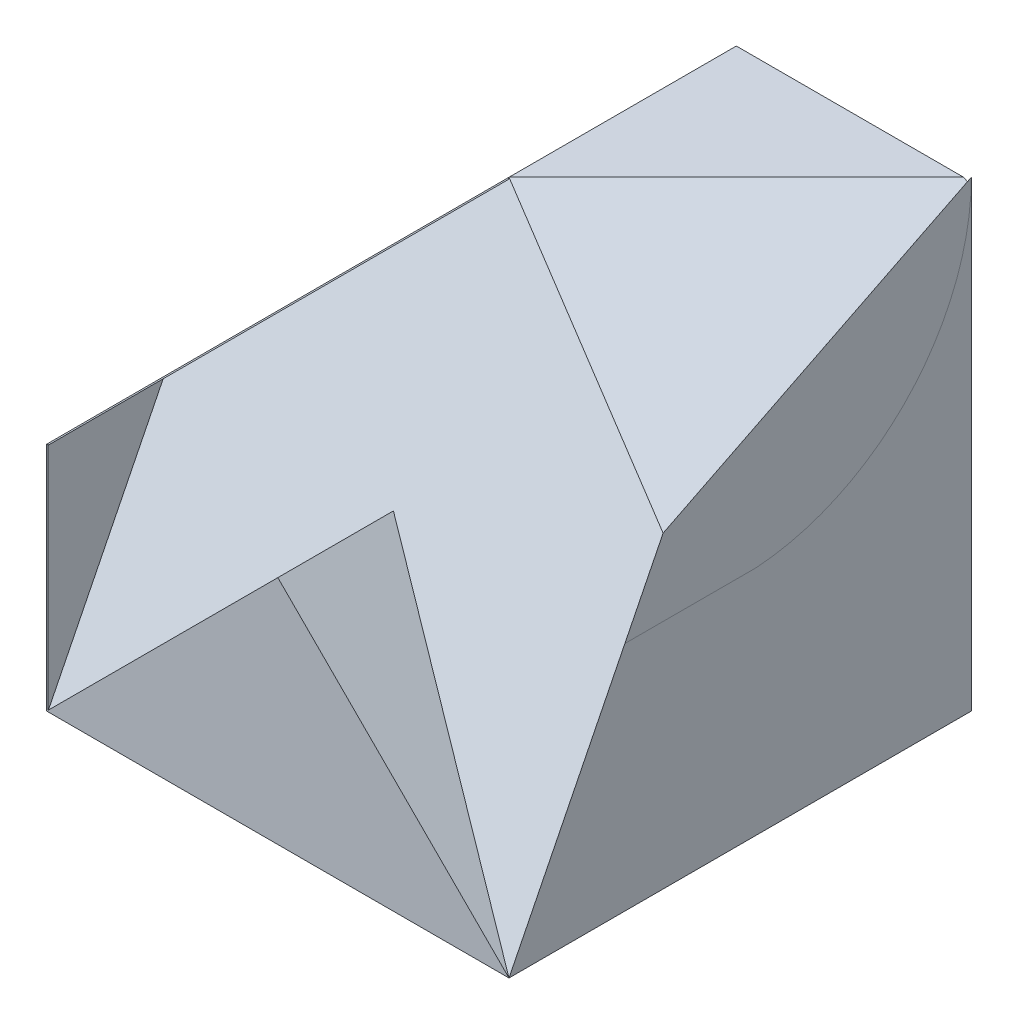
ISO-10303-21;
HEADER;
FILE_DESCRIPTION(('STEP AP214'),'2;1');
FILE_NAME('part.step','',(''),(''),'','','');
FILE_SCHEMA(('AUTOMOTIVE_DESIGN { 1 0 10303 214 1 1 1 1 }'));
ENDSEC;
DATA;
#1=APPLICATION_CONTEXT('core data for automotive mechanical design processes');
#2=APPLICATION_PROTOCOL_DEFINITION('international standard','automotive_design',2000,#1);
#3=PRODUCT_CONTEXT('',#1,'mechanical');
#4=PRODUCT('Part','Part','',(#3));
#5=PRODUCT_RELATED_PRODUCT_CATEGORY('part','',(#4));
#6=PRODUCT_DEFINITION_FORMATION('','',#4);
#7=PRODUCT_DEFINITION_CONTEXT('part definition',#1,'design');
#8=PRODUCT_DEFINITION('design','',#6,#7);
#9=PRODUCT_DEFINITION_SHAPE('','',#8);
#10=(LENGTH_UNIT() NAMED_UNIT(*) SI_UNIT(.MILLI.,.METRE.));
#11=(NAMED_UNIT(*) PLANE_ANGLE_UNIT() SI_UNIT($,.RADIAN.));
#12=(NAMED_UNIT(*) SI_UNIT($,.STERADIAN.) SOLID_ANGLE_UNIT());
#13=UNCERTAINTY_MEASURE_WITH_UNIT(LENGTH_MEASURE(1.E-05),#10,'distance_accuracy_value','');
#14=(GEOMETRIC_REPRESENTATION_CONTEXT(3) GLOBAL_UNCERTAINTY_ASSIGNED_CONTEXT((#13)) GLOBAL_UNIT_ASSIGNED_CONTEXT((#10,
#11,#12)) REPRESENTATION_CONTEXT('',''));
#15=CARTESIAN_POINT('',(0.,0.,0.));
#16=DIRECTION('',(0.,0.,1.));
#17=DIRECTION('',(1.,0.,0.));
#18=AXIS2_PLACEMENT_3D('',#15,#16,#17);
#19=CARTESIAN_POINT('',(60.,0.,60.));
#20=DIRECTION('',(-1.,0.,0.));
#21=DIRECTION('',(0.,0.,1.));
#22=AXIS2_PLACEMENT_3D('',#19,#20,#21);
#23=PLANE('',#22);
#24=CARTESIAN_POINT('',(60.,60.,30.));
#25=DIRECTION('',(1.,0.,0.));
#26=DIRECTION('',(0.,0.,1.));
#27=AXIS2_PLACEMENT_3D('',#24,#25,#26);
#28=CIRCLE('',#27,30.);
#29=CARTESIAN_POINT('',(60.,30.0742678610852,27.8903659203736));
#30=VERTEX_POINT('',#29);
#31=CARTESIAN_POINT('',(60.,60.,0.));
#32=VERTEX_POINT('',#31);
#33=EDGE_CURVE('E47',#30,#32,#28,.T.);
#34=ORIENTED_EDGE('',*,*,#33,.F.);
#35=DIRECTION('',(0.,0.,-1.));
#36=VECTOR('',#35,1.);
#37=CARTESIAN_POINT('',(60.,30.0742678610852,27.8903659203736));
#38=LINE('',#37,#36);
#39=CARTESIAN_POINT('',(60.,30.0742678610852,44.9628660694574));
#40=VERTEX_POINT('',#39);
#41=EDGE_CURVE('E161',#40,#30,#38,.T.);
#42=ORIENTED_EDGE('',*,*,#41,.F.);
#43=DIRECTION('',(0.,-0.894427190999916,0.447213595499959));
#44=VECTOR('',#43,1.);
#45=CARTESIAN_POINT('',(60.,0.,60.0000000000001));
#46=LINE('',#45,#44);
#47=CARTESIAN_POINT('',(60.,0.,60.));
#48=VERTEX_POINT('',#47);
#49=EDGE_CURVE('E241',#40,#48,#46,.T.);
#50=ORIENTED_EDGE('',*,*,#49,.T.);
#51=DIRECTION('',(0.,0.,-1.));
#52=VECTOR('',#51,1.);
#53=CARTESIAN_POINT('',(60.,0.,60.));
#54=LINE('',#53,#52);
#55=CARTESIAN_POINT('',(60.,0.,0.));
#56=VERTEX_POINT('',#55);
#57=EDGE_CURVE('E244',#48,#56,#54,.T.);
#58=ORIENTED_EDGE('',*,*,#57,.T.);
#59=DIRECTION('',(0.,1.,0.));
#60=VECTOR('',#59,1.);
#61=CARTESIAN_POINT('',(60.,0.,0.));
#62=LINE('',#61,#60);
#63=EDGE_CURVE('E234',#56,#32,#62,.T.);
#64=ORIENTED_EDGE('',*,*,#63,.T.);
#65=EDGE_LOOP('',(#34,#42,#50,#58,#64));
#66=FACE_BOUND('',#65,.T.);
#67=ADVANCED_FACE('F33',(#66),#23,.F.);
#68=CARTESIAN_POINT('',(30.,60.,0.));
#69=DIRECTION('',(0.707106781186547,-0.707106781186548,0.));
#70=DIRECTION('',(0.707106781186548,0.707106781186547,0.));
#71=AXIS2_PLACEMENT_3D('',#68,#69,#70);
#72=PLANE('',#71);
#73=DIRECTION('',(0.707106781186548,0.707106781186547,0.));
#74=VECTOR('',#73,1.);
#75=CARTESIAN_POINT('',(0.,30.,0.5));
#76=LINE('',#75,#74);
#77=CARTESIAN_POINT('',(0.,30.,0.5));
#78=VERTEX_POINT('',#77);
#79=CARTESIAN_POINT('',(30.,60.,0.5));
#80=VERTEX_POINT('',#79);
#81=EDGE_CURVE('E179',#78,#80,#76,.T.);
#82=ORIENTED_EDGE('',*,*,#81,.F.);
#83=DIRECTION('',(0.,0.,1.));
#84=VECTOR('',#83,1.);
#85=CARTESIAN_POINT('',(0.,30.,0.));
#86=LINE('',#85,#84);
#87=CARTESIAN_POINT('',(0.,30.,60.));
#88=VERTEX_POINT('',#87);
#89=EDGE_CURVE('E222',#78,#88,#86,.T.);
#90=ORIENTED_EDGE('',*,*,#89,.T.);
#91=DIRECTION('',(0.577350269189625,0.577350269189625,-0.577350269189626));
#92=VECTOR('',#91,1.);
#93=CARTESIAN_POINT('',(30.,60.,30.));
#94=LINE('',#93,#92);
#95=CARTESIAN_POINT('',(30.,60.,30.));
#96=VERTEX_POINT('',#95);
#97=EDGE_CURVE('E184',#88,#96,#94,.T.);
#98=ORIENTED_EDGE('',*,*,#97,.T.);
#99=DIRECTION('',(0.,0.,1.));
#100=VECTOR('',#99,1.);
#101=CARTESIAN_POINT('',(30.,60.,0.));
#102=LINE('',#101,#100);
#103=EDGE_CURVE('E231',#80,#96,#102,.T.);
#104=ORIENTED_EDGE('',*,*,#103,.F.);
#105=EDGE_LOOP('',(#82,#90,#98,#104));
#106=FACE_BOUND('',#105,.T.);
#107=ADVANCED_FACE('F292',(#106),#72,.F.);
#108=CARTESIAN_POINT('',(0.,60.,60.));
#109=DIRECTION('',(0.,-1.,0.));
#110=DIRECTION('',(0.,0.,-1.));
#111=AXIS2_PLACEMENT_3D('',#108,#109,#110);
#112=PLANE('',#111);
#113=DIRECTION('',(1.,0.,0.));
#114=VECTOR('',#113,1.);
#115=CARTESIAN_POINT('',(30.,60.,0.5));
#116=LINE('',#115,#114);
#117=CARTESIAN_POINT('',(59.5,60.,0.499999999999997));
#118=VERTEX_POINT('',#117);
#119=EDGE_CURVE('E55',#80,#118,#116,.T.);
#120=ORIENTED_EDGE('',*,*,#119,.F.);
#121=ORIENTED_EDGE('',*,*,#103,.T.);
#122=DIRECTION('',(-0.707106781186547,0.,0.707106781186548));
#123=VECTOR('',#122,1.);
#124=CARTESIAN_POINT('',(30.,60.,30.));
#125=LINE('',#124,#123);
#126=EDGE_CURVE('E226',#118,#96,#125,.T.);
#127=ORIENTED_EDGE('',*,*,#126,.F.);
#128=EDGE_LOOP('',(#120,#121,#127));
#129=FACE_BOUND('',#128,.T.);
#130=ADVANCED_FACE('F345',(#129),#112,.F.);
#131=CARTESIAN_POINT('',(0.,0.,60.));
#132=DIRECTION('',(1.,0.,0.));
#133=DIRECTION('',(0.,0.,-1.));
#134=AXIS2_PLACEMENT_3D('',#131,#132,#133);
#135=PLANE('',#134);
#136=DIRECTION('',(0.,0.,-1.));
#137=VECTOR('',#136,1.);
#138=CARTESIAN_POINT('',(0.,0.,60.));
#139=LINE('',#138,#137);
#140=CARTESIAN_POINT('',(0.,0.,60.));
#141=VERTEX_POINT('',#140);
#142=CARTESIAN_POINT('',(0.,0.,0.));
#143=VERTEX_POINT('',#142);
#144=EDGE_CURVE('E230',#141,#143,#139,.T.);
#145=ORIENTED_EDGE('',*,*,#144,.F.);
#146=DIRECTION('',(0.,1.,0.));
#147=VECTOR('',#146,1.);
#148=CARTESIAN_POINT('',(0.,0.,60.));
#149=LINE('',#148,#147);
#150=EDGE_CURVE('E198',#141,#88,#149,.T.);
#151=ORIENTED_EDGE('',*,*,#150,.T.);
#152=ORIENTED_EDGE('',*,*,#89,.F.);
#153=CARTESIAN_POINT('',(0.,30.,0.));
#154=VERTEX_POINT('',#153);
#155=EDGE_CURVE('E223',#154,#78,#86,.T.);
#156=ORIENTED_EDGE('',*,*,#155,.F.);
#157=DIRECTION('',(0.,-1.,0.));
#158=VECTOR('',#157,1.);
#159=CARTESIAN_POINT('',(0.,0.,0.));
#160=LINE('',#159,#158);
#161=EDGE_CURVE('E225',#154,#143,#160,.T.);
#162=ORIENTED_EDGE('',*,*,#161,.T.);
#163=EDGE_LOOP('',(#145,#151,#152,#156,#162));
#164=FACE_BOUND('',#163,.T.);
#165=ADVANCED_FACE('F287',(#164),#135,.F.);
#166=CARTESIAN_POINT('',(0.,0.,60.));
#167=DIRECTION('',(0.,1.,0.));
#168=DIRECTION('',(0.,0.,1.));
#169=AXIS2_PLACEMENT_3D('',#166,#167,#168);
#170=PLANE('',#169);
#171=DIRECTION('',(1.,0.,0.));
#172=VECTOR('',#171,1.);
#173=CARTESIAN_POINT('',(0.,0.,0.));
#174=LINE('',#173,#172);
#175=EDGE_CURVE('E233',#143,#56,#174,.T.);
#176=ORIENTED_EDGE('',*,*,#175,.T.);
#177=ORIENTED_EDGE('',*,*,#57,.F.);
#178=DIRECTION('',(1.,0.,0.));
#179=VECTOR('',#178,1.);
#180=CARTESIAN_POINT('',(0.,0.,60.));
#181=LINE('',#180,#179);
#182=EDGE_CURVE('E235',#141,#48,#181,.T.);
#183=ORIENTED_EDGE('',*,*,#182,.F.);
#184=ORIENTED_EDGE('',*,*,#144,.T.);
#185=EDGE_LOOP('',(#176,#177,#183,#184));
#186=FACE_BOUND('',#185,.T.);
#187=ADVANCED_FACE('F326',(#186),#170,.F.);
#188=CARTESIAN_POINT('',(0.,0.,0.));
#189=DIRECTION('',(0.,0.,-1.));
#190=DIRECTION('',(-1.,0.,0.));
#191=AXIS2_PLACEMENT_3D('',#188,#189,#190);
#192=PLANE('',#191);
#193=DIRECTION('',(-1.,0.,0.));
#194=VECTOR('',#193,1.);
#195=CARTESIAN_POINT('',(30.,30.,0.));
#196=LINE('',#195,#194);
#197=CARTESIAN_POINT('',(30.,30.,0.));
#198=VERTEX_POINT('',#197);
#199=EDGE_CURVE('E167',#198,#154,#196,.T.);
#200=ORIENTED_EDGE('',*,*,#199,.F.);
#201=CARTESIAN_POINT('',(30.,60.,0.));
#202=DIRECTION('',(0.,0.,-1.));
#203=DIRECTION('',(-1.,0.,0.));
#204=AXIS2_PLACEMENT_3D('',#201,#202,#203);
#205=CIRCLE('',#204,30.);
#206=EDGE_CURVE('E164',#32,#198,#205,.T.);
#207=ORIENTED_EDGE('',*,*,#206,.F.);
#208=ORIENTED_EDGE('',*,*,#63,.F.);
#209=ORIENTED_EDGE('',*,*,#175,.F.);
#210=ORIENTED_EDGE('',*,*,#161,.F.);
#211=EDGE_LOOP('',(#200,#207,#208,#209,#210));
#212=FACE_BOUND('',#211,.T.);
#213=ADVANCED_FACE('F279',(#212),#192,.T.);
#214=CARTESIAN_POINT('',(30.,60.,30.));
#215=DIRECTION('',(-0.408248290463863,-0.816496580927726,-0.408248290463863));
#216=DIRECTION('',(0.,0.447213595499958,-0.894427190999916));
#217=AXIS2_PLACEMENT_3D('',#214,#215,#216);
#218=PLANE('',#217);
#219=DIRECTION('',(0.,0.447213595499958,-0.894427190999916));
#220=VECTOR('',#219,1.);
#221=CARTESIAN_POINT('',(60.,60.,0.));
#222=LINE('',#221,#220);
#223=CARTESIAN_POINT('',(60.,40.,40.));
#224=VERTEX_POINT('',#223);
#225=EDGE_CURVE('E239',#224,#32,#222,.T.);
#226=ORIENTED_EDGE('',*,*,#225,.T.);
#227=CARTESIAN_POINT('',(30.,60.,30.));
#228=DIRECTION('',(-0.408248290463863,-0.816496580927726,-0.408248290463863));
#229=DIRECTION('',(0.182574185835056,0.365148371670111,-0.912870929175277));
#230=AXIS2_PLACEMENT_3D('',#227,#228,#229);
#231=ELLIPSE('',#230,73.4846922834953,30.);
#232=CARTESIAN_POINT('',(59.9989626332753,59.7505186833624,0.5));
#233=VERTEX_POINT('',#232);
#234=EDGE_CURVE('E11',#32,#233,#231,.T.);
#235=ORIENTED_EDGE('',*,*,#234,.T.);
#236=DIRECTION('',(0.894427190999916,-0.447213595499958,0.));
#237=VECTOR('',#236,1.);
#238=CARTESIAN_POINT('',(35.9,71.8,0.5));
#239=LINE('',#238,#237);
#240=EDGE_CURVE('E40',#118,#233,#239,.T.);
#241=ORIENTED_EDGE('',*,*,#240,.F.);
#242=ORIENTED_EDGE('',*,*,#126,.T.);
#243=DIRECTION('',(0.801783725737273,-0.534522483824849,0.267261241912425));
#244=VECTOR('',#243,1.);
#245=CARTESIAN_POINT('',(30.,60.,30.));
#246=LINE('',#245,#244);
#247=EDGE_CURVE('E229',#96,#224,#246,.T.);
#248=ORIENTED_EDGE('',*,*,#247,.T.);
#249=EDGE_LOOP('',(#226,#235,#241,#242,#248));
#250=FACE_BOUND('',#249,.T.);
#251=ADVANCED_FACE('F272',(#250),#218,.F.);
#252=CARTESIAN_POINT('',(0.,24.,48.));
#253=DIRECTION('',(0.,0.447213595499958,0.894427190999916));
#254=DIRECTION('',(0.,-0.894427190999916,0.447213595499958));
#255=AXIS2_PLACEMENT_3D('',#252,#253,#254);
#256=PLANE('',#255);
#257=DIRECTION('',(0.,0.894427190999916,-0.447213595499958));
#258=VECTOR('',#257,1.);
#259=CARTESIAN_POINT('',(30.,24.,48.));
#260=LINE('',#259,#258);
#261=CARTESIAN_POINT('',(29.9999999999999,59.787867965644,30.106066017178));
#262=VERTEX_POINT('',#261);
#263=EDGE_CURVE('E195',#262,#96,#260,.T.);
#264=ORIENTED_EDGE('',*,*,#263,.F.);
#265=DIRECTION('',(-0.666666666666667,-0.666666666666667,0.333333333333334));
#266=VECTOR('',#265,1.);
#267=CARTESIAN_POINT('',(-3.21548220313556,26.5723857625085,46.7138071187458));
#268=LINE('',#267,#266);
#269=CARTESIAN_POINT('',(0.15,29.937867965644,45.031066017178));
#270=VERTEX_POINT('',#269);
#271=EDGE_CURVE('E188',#262,#270,#268,.T.);
#272=ORIENTED_EDGE('',*,*,#271,.T.);
#273=DIRECTION('',(0.,-0.894427190999916,0.447213595499958));
#274=VECTOR('',#273,1.);
#275=CARTESIAN_POINT('',(0.15,30.,45.));
#276=LINE('',#275,#274);
#277=CARTESIAN_POINT('',(0.15,0.15,59.925));
#278=VERTEX_POINT('',#277);
#279=EDGE_CURVE('E202',#270,#278,#276,.T.);
#280=ORIENTED_EDGE('',*,*,#279,.T.);
#281=DIRECTION('',(-0.666666666666667,-0.666666666666667,0.333333333333334));
#282=VECTOR('',#281,1.);
#283=CARTESIAN_POINT('',(13.3333333333334,13.3333333333334,53.3333333333333));
#284=LINE('',#283,#282);
#285=CARTESIAN_POINT('',(30.,30.,45.));
#286=VERTEX_POINT('',#285);
#287=EDGE_CURVE('E255',#286,#278,#284,.T.);
#288=ORIENTED_EDGE('',*,*,#287,.F.);
#289=DIRECTION('',(-0.666666666666667,0.666666666666666,-0.333333333333333));
#290=VECTOR('',#289,1.);
#291=CARTESIAN_POINT('',(20.,40.,40.));
#292=LINE('',#291,#290);
#293=EDGE_CURVE('E238',#48,#286,#292,.T.);
#294=ORIENTED_EDGE('',*,*,#293,.F.);
#295=ORIENTED_EDGE('',*,*,#49,.F.);
#296=DIRECTION('',(-1.,0.,0.));
#297=VECTOR('',#296,1.);
#298=CARTESIAN_POINT('',(60.0001,30.0742678610852,44.9628660694574));
#299=LINE('',#298,#297);
#300=CARTESIAN_POINT('',(60.0001,30.0742678610852,44.9628660694574));
#301=VERTEX_POINT('',#300);
#302=EDGE_CURVE('E169',#301,#40,#299,.T.);
#303=ORIENTED_EDGE('',*,*,#302,.F.);
#304=DIRECTION('',(0.,-0.894427190999916,0.447213595499957));
#305=VECTOR('',#304,1.);
#306=CARTESIAN_POINT('',(60.0001,30.0742678610852,44.9628660694574));
#307=LINE('',#306,#305);
#308=CARTESIAN_POINT('',(60.0001,40.,40.));
#309=VERTEX_POINT('',#308);
#310=EDGE_CURVE('E151',#309,#301,#307,.T.);
#311=ORIENTED_EDGE('',*,*,#310,.F.);
#312=DIRECTION('',(-1.,0.,0.));
#313=VECTOR('',#312,1.);
#314=CARTESIAN_POINT('',(60.0001,40.,40.));
#315=LINE('',#314,#313);
#316=EDGE_CURVE('E148',#309,#224,#315,.T.);
#317=ORIENTED_EDGE('',*,*,#316,.T.);
#318=ORIENTED_EDGE('',*,*,#247,.F.);
#319=EDGE_LOOP('',(#264,#272,#280,#288,#294,#295,#303,#311,#317,#318));
#320=FACE_BOUND('',#319,.T.);
#321=ADVANCED_FACE('F312',(#320),#256,.T.);
#322=CARTESIAN_POINT('',(0.,0.,0.));
#323=DIRECTION('',(-0.707106781186548,0.707106781186547,0.));
#324=DIRECTION('',(-0.707106781186547,-0.707106781186548,0.));
#325=AXIS2_PLACEMENT_3D('',#322,#323,#324);
#326=PLANE('',#325);
#327=DIRECTION('',(0.,0.,-1.));
#328=VECTOR('',#327,1.);
#329=CARTESIAN_POINT('',(0.15,0.15,0.));
#330=LINE('',#329,#328);
#331=CARTESIAN_POINT('',(0.15,0.15,60.));
#332=VERTEX_POINT('',#331);
#333=EDGE_CURVE('E211',#332,#278,#330,.T.);
#334=ORIENTED_EDGE('',*,*,#333,.F.);
#335=DIRECTION('',(-0.707106781186547,-0.707106781186548,0.));
#336=VECTOR('',#335,1.);
#337=CARTESIAN_POINT('',(0.,0.,60.));
#338=LINE('',#337,#336);
#339=CARTESIAN_POINT('',(30.,30.,60.));
#340=VERTEX_POINT('',#339);
#341=EDGE_CURVE('E217',#340,#332,#338,.T.);
#342=ORIENTED_EDGE('',*,*,#341,.F.);
#343=DIRECTION('',(0.,0.,1.));
#344=VECTOR('',#343,1.);
#345=CARTESIAN_POINT('',(30.,30.,0.));
#346=LINE('',#345,#344);
#347=EDGE_CURVE('E220',#286,#340,#346,.T.);
#348=ORIENTED_EDGE('',*,*,#347,.F.);
#349=ORIENTED_EDGE('',*,*,#287,.T.);
#350=EDGE_LOOP('',(#334,#342,#348,#349));
#351=FACE_BOUND('',#350,.T.);
#352=ADVANCED_FACE('F331',(#351),#326,.T.);
#353=CARTESIAN_POINT('',(30.,30.,0.));
#354=DIRECTION('',(0.707106781186547,0.707106781186548,0.));
#355=DIRECTION('',(-0.707106781186548,0.707106781186547,0.));
#356=AXIS2_PLACEMENT_3D('',#353,#354,#355);
#357=PLANE('',#356);
#358=DIRECTION('',(-0.707106781186548,0.707106781186547,0.));
#359=VECTOR('',#358,1.);
#360=CARTESIAN_POINT('',(30.,30.,60.));
#361=LINE('',#360,#359);
#362=EDGE_CURVE('E214',#48,#340,#361,.T.);
#363=ORIENTED_EDGE('',*,*,#362,.F.);
#364=ORIENTED_EDGE('',*,*,#293,.T.);
#365=ORIENTED_EDGE('',*,*,#347,.T.);
#366=EDGE_LOOP('',(#363,#364,#365));
#367=FACE_BOUND('',#366,.T.);
#368=ADVANCED_FACE('F329',(#367),#357,.T.);
#369=CARTESIAN_POINT('',(0.,0.,60.));
#370=DIRECTION('',(0.,0.,-1.));
#371=DIRECTION('',(-1.,0.,0.));
#372=AXIS2_PLACEMENT_3D('',#369,#370,#371);
#373=PLANE('',#372);
#374=DIRECTION('',(-1.,0.,0.));
#375=VECTOR('',#374,1.);
#376=CARTESIAN_POINT('',(0.15,30.,60.));
#377=LINE('',#376,#375);
#378=CARTESIAN_POINT('',(0.15,30.,60.));
#379=VERTEX_POINT('',#378);
#380=EDGE_CURVE('E206',#379,#88,#377,.T.);
#381=ORIENTED_EDGE('',*,*,#380,.T.);
#382=ORIENTED_EDGE('',*,*,#150,.F.);
#383=ORIENTED_EDGE('',*,*,#182,.T.);
#384=ORIENTED_EDGE('',*,*,#362,.T.);
#385=ORIENTED_EDGE('',*,*,#341,.T.);
#386=DIRECTION('',(0.,1.,0.));
#387=VECTOR('',#386,1.);
#388=CARTESIAN_POINT('',(0.15,0.,60.));
#389=LINE('',#388,#387);
#390=EDGE_CURVE('E204',#332,#379,#389,.T.);
#391=ORIENTED_EDGE('',*,*,#390,.T.);
#392=EDGE_LOOP('',(#381,#382,#383,#384,#385,#391));
#393=FACE_BOUND('',#392,.T.);
#394=ADVANCED_FACE('F304',(#393),#373,.F.);
#395=CARTESIAN_POINT('',(0.15,30.,60.));
#396=DIRECTION('',(0.,1.,0.));
#397=DIRECTION('',(0.,0.,1.));
#398=AXIS2_PLACEMENT_3D('',#395,#396,#397);
#399=PLANE('',#398);
#400=DIRECTION('',(0.894427190999916,0.,-0.447213595499959));
#401=VECTOR('',#400,1.);
#402=CARTESIAN_POINT('',(0.12,30.,59.94));
#403=LINE('',#402,#401);
#404=CARTESIAN_POINT('',(0.15,30.,59.925));
#405=VERTEX_POINT('',#404);
#406=EDGE_CURVE('E193',#88,#405,#403,.T.);
#407=ORIENTED_EDGE('',*,*,#406,.F.);
#408=ORIENTED_EDGE('',*,*,#380,.F.);
#409=DIRECTION('',(0.,0.,-1.));
#410=VECTOR('',#409,1.);
#411=CARTESIAN_POINT('',(0.15,30.,60.));
#412=LINE('',#411,#410);
#413=EDGE_CURVE('E199',#379,#405,#412,.T.);
#414=ORIENTED_EDGE('',*,*,#413,.T.);
#415=EDGE_LOOP('',(#407,#408,#414));
#416=FACE_BOUND('',#415,.T.);
#417=ADVANCED_FACE('F301',(#416),#399,.T.);
#418=CARTESIAN_POINT('',(0.15,0.,0.));
#419=DIRECTION('',(1.,0.,0.));
#420=DIRECTION('',(0.,0.,-1.));
#421=AXIS2_PLACEMENT_3D('',#418,#419,#420);
#422=PLANE('',#421);
#423=DIRECTION('',(0.,-0.894427190999916,0.447213595499959));
#424=VECTOR('',#423,1.);
#425=CARTESIAN_POINT('',(0.15,29.97,59.94));
#426=LINE('',#425,#424);
#427=CARTESIAN_POINT('',(0.15,29.937867965644,59.956066017178));
#428=VERTEX_POINT('',#427);
#429=EDGE_CURVE('E261',#405,#428,#426,.T.);
#430=ORIENTED_EDGE('',*,*,#429,.F.);
#431=ORIENTED_EDGE('',*,*,#413,.F.);
#432=ORIENTED_EDGE('',*,*,#390,.F.);
#433=ORIENTED_EDGE('',*,*,#333,.T.);
#434=ORIENTED_EDGE('',*,*,#279,.F.);
#435=DIRECTION('',(0.,0.,1.));
#436=VECTOR('',#435,1.);
#437=CARTESIAN_POINT('',(0.15,29.937867965644,0.));
#438=LINE('',#437,#436);
#439=EDGE_CURVE('E258',#270,#428,#438,.T.);
#440=ORIENTED_EDGE('',*,*,#439,.T.);
#441=EDGE_LOOP('',(#430,#431,#432,#433,#434,#440));
#442=FACE_BOUND('',#441,.T.);
#443=ADVANCED_FACE('F308',(#442),#422,.T.);
#444=CARTESIAN_POINT('',(30.106066017178,59.893933982822,30.));
#445=DIRECTION('',(0.408248290463864,0.408248290463864,0.816496580927726));
#446=DIRECTION('',(0.894427190999916,0.,-0.447213595499959));
#447=AXIS2_PLACEMENT_3D('',#444,#445,#446);
#448=PLANE('',#447);
#449=DIRECTION('',(0.577350269189625,0.577350269189625,-0.577350269189626));
#450=VECTOR('',#449,1.);
#451=CARTESIAN_POINT('',(30.106066017178,59.893933982822,30.));
#452=LINE('',#451,#450);
#453=EDGE_CURVE('E185',#428,#262,#452,.T.);
#454=ORIENTED_EDGE('',*,*,#453,.T.);
#455=ORIENTED_EDGE('',*,*,#263,.T.);
#456=ORIENTED_EDGE('',*,*,#97,.F.);
#457=ORIENTED_EDGE('',*,*,#406,.T.);
#458=ORIENTED_EDGE('',*,*,#429,.T.);
#459=EDGE_LOOP('',(#454,#455,#456,#457,#458));
#460=FACE_BOUND('',#459,.T.);
#461=ADVANCED_FACE('F296',(#460),#448,.T.);
#462=CARTESIAN_POINT('',(-14.893933982822,14.893933982822,0.));
#463=DIRECTION('',(-0.707106781186547,0.707106781186547,0.));
#464=DIRECTION('',(-0.707106781186548,-0.707106781186548,0.));
#465=AXIS2_PLACEMENT_3D('',#462,#463,#464);
#466=PLANE('',#465);
#467=ORIENTED_EDGE('',*,*,#271,.F.);
#468=ORIENTED_EDGE('',*,*,#453,.F.);
#469=ORIENTED_EDGE('',*,*,#439,.F.);
#470=EDGE_LOOP('',(#467,#468,#469));
#471=FACE_BOUND('',#470,.T.);
#472=ADVANCED_FACE('F379',(#471),#466,.F.);
#473=CARTESIAN_POINT('',(30.,60.,0.5));
#474=DIRECTION('',(0.,0.,-1.));
#475=DIRECTION('',(-1.,0.,0.));
#476=AXIS2_PLACEMENT_3D('',#473,#474,#475);
#477=CYLINDRICAL_SURFACE('',#476,30.);
#478=ORIENTED_EDGE('',*,*,#206,.T.);
#479=DIRECTION('',(0.,0.,-1.));
#480=VECTOR('',#479,1.);
#481=CARTESIAN_POINT('',(30.,30.,0.5));
#482=LINE('',#481,#480);
#483=CARTESIAN_POINT('',(30.,30.,0.5));
#484=VERTEX_POINT('',#483);
#485=EDGE_CURVE('E180',#484,#198,#482,.T.);
#486=ORIENTED_EDGE('',*,*,#485,.F.);
#487=CARTESIAN_POINT('',(30.,60.,0.5));
#488=DIRECTION('',(0.,0.,-1.));
#489=DIRECTION('',(-1.,0.,0.));
#490=AXIS2_PLACEMENT_3D('',#487,#488,#489);
#491=CIRCLE('',#490,30.);
#492=EDGE_CURVE('E174',#233,#484,#491,.T.);
#493=ORIENTED_EDGE('',*,*,#492,.F.);
#494=ORIENTED_EDGE('',*,*,#234,.F.);
#495=EDGE_LOOP('',(#478,#486,#493,#494));
#496=FACE_BOUND('',#495,.T.);
#497=ADVANCED_FACE('F269',(#496),#477,.F.);
#498=CARTESIAN_POINT('',(30.,60.,0.5));
#499=DIRECTION('',(0.,0.,-1.));
#500=DIRECTION('',(-1.,0.,0.));
#501=AXIS2_PLACEMENT_3D('',#498,#499,#500);
#502=PLANE('',#501);
#503=ORIENTED_EDGE('',*,*,#240,.T.);
#504=ORIENTED_EDGE('',*,*,#492,.T.);
#505=DIRECTION('',(-1.,0.,0.));
#506=VECTOR('',#505,1.);
#507=CARTESIAN_POINT('',(30.,30.,0.5));
#508=LINE('',#507,#506);
#509=EDGE_CURVE('E176',#484,#78,#508,.T.);
#510=ORIENTED_EDGE('',*,*,#509,.T.);
#511=ORIENTED_EDGE('',*,*,#81,.T.);
#512=ORIENTED_EDGE('',*,*,#119,.T.);
#513=EDGE_LOOP('',(#503,#504,#510,#511,#512));
#514=FACE_BOUND('',#513,.T.);
#515=ADVANCED_FACE('F264',(#514),#502,.T.);
#516=CARTESIAN_POINT('',(30.,30.,0.5));
#517=DIRECTION('',(0.,-1.,0.));
#518=DIRECTION('',(1.,0.,0.));
#519=AXIS2_PLACEMENT_3D('',#516,#517,#518);
#520=PLANE('',#519);
#521=ORIENTED_EDGE('',*,*,#199,.T.);
#522=ORIENTED_EDGE('',*,*,#155,.T.);
#523=ORIENTED_EDGE('',*,*,#509,.F.);
#524=ORIENTED_EDGE('',*,*,#485,.T.);
#525=EDGE_LOOP('',(#521,#522,#523,#524));
#526=FACE_BOUND('',#525,.T.);
#527=ADVANCED_FACE('F283',(#526),#520,.F.);
#528=CARTESIAN_POINT('',(60.0001,60.,30.));
#529=DIRECTION('',(-1.,0.,0.));
#530=DIRECTION('',(0.,0.,1.));
#531=AXIS2_PLACEMENT_3D('',#528,#529,#530);
#532=CYLINDRICAL_SURFACE('',#531,30.);
#533=ORIENTED_EDGE('',*,*,#33,.T.);
#534=DIRECTION('',(-1.,0.,0.));
#535=VECTOR('',#534,1.);
#536=CARTESIAN_POINT('',(60.0001,60.,0.));
#537=LINE('',#536,#535);
#538=CARTESIAN_POINT('',(60.0001,60.,0.));
#539=VERTEX_POINT('',#538);
#540=EDGE_CURVE('E146',#539,#32,#537,.T.);
#541=ORIENTED_EDGE('',*,*,#540,.F.);
#542=CARTESIAN_POINT('',(60.0001,60.,30.));
#543=DIRECTION('',(1.,0.,0.));
#544=DIRECTION('',(0.,0.,1.));
#545=AXIS2_PLACEMENT_3D('',#542,#543,#544);
#546=CIRCLE('',#545,30.);
#547=CARTESIAN_POINT('',(60.0001,30.0742678610852,27.8903659203736));
#548=VERTEX_POINT('',#547);
#549=EDGE_CURVE('E152',#548,#539,#546,.T.);
#550=ORIENTED_EDGE('',*,*,#549,.F.);
#551=DIRECTION('',(-1.,0.,0.));
#552=VECTOR('',#551,1.);
#553=CARTESIAN_POINT('',(60.0001,30.0742678610852,27.8903659203736));
#554=LINE('',#553,#552);
#555=EDGE_CURVE('E316',#548,#30,#554,.T.);
#556=ORIENTED_EDGE('',*,*,#555,.T.);
#557=EDGE_LOOP('',(#533,#541,#550,#556));
#558=FACE_BOUND('',#557,.T.);
#559=ADVANCED_FACE('F163',(#558),#532,.T.);
#560=CARTESIAN_POINT('',(60.0001,40.,40.));
#561=DIRECTION('',(0.,-0.894427190999916,-0.447213595499958));
#562=DIRECTION('',(0.,0.447213595499958,-0.894427190999916));
#563=AXIS2_PLACEMENT_3D('',#560,#561,#562);
#564=PLANE('',#563);
#565=ORIENTED_EDGE('',*,*,#225,.F.);
#566=ORIENTED_EDGE('',*,*,#316,.F.);
#567=DIRECTION('',(0.,-0.447213595499958,0.894427190999916));
#568=VECTOR('',#567,1.);
#569=CARTESIAN_POINT('',(60.0001,40.,40.));
#570=LINE('',#569,#568);
#571=EDGE_CURVE('E141',#539,#309,#570,.T.);
#572=ORIENTED_EDGE('',*,*,#571,.F.);
#573=ORIENTED_EDGE('',*,*,#540,.T.);
#574=EDGE_LOOP('',(#565,#566,#572,#573));
#575=FACE_BOUND('',#574,.T.);
#576=ADVANCED_FACE('F144',(#575),#564,.F.);
#577=CARTESIAN_POINT('',(60.0001,30.0742678610852,27.8903659203736));
#578=DIRECTION('',(0.,1.,0.));
#579=DIRECTION('',(0.,0.,1.));
#580=AXIS2_PLACEMENT_3D('',#577,#578,#579);
#581=PLANE('',#580);
#582=ORIENTED_EDGE('',*,*,#41,.T.);
#583=ORIENTED_EDGE('',*,*,#555,.F.);
#584=DIRECTION('',(0.,0.,-1.));
#585=VECTOR('',#584,1.);
#586=CARTESIAN_POINT('',(60.0001,30.0742678610852,27.8903659203736));
#587=LINE('',#586,#585);
#588=EDGE_CURVE('E157',#301,#548,#587,.T.);
#589=ORIENTED_EDGE('',*,*,#588,.F.);
#590=ORIENTED_EDGE('',*,*,#302,.T.);
#591=EDGE_LOOP('',(#582,#583,#589,#590));
#592=FACE_BOUND('',#591,.T.);
#593=ADVANCED_FACE('F322',(#592),#581,.F.);
#594=CARTESIAN_POINT('',(60.0001,60.,30.));
#595=DIRECTION('',(-1.,0.,0.));
#596=DIRECTION('',(0.,0.,1.));
#597=AXIS2_PLACEMENT_3D('',#594,#595,#596);
#598=PLANE('',#597);
#599=ORIENTED_EDGE('',*,*,#549,.T.);
#600=ORIENTED_EDGE('',*,*,#571,.T.);
#601=ORIENTED_EDGE('',*,*,#310,.T.);
#602=ORIENTED_EDGE('',*,*,#588,.T.);
#603=EDGE_LOOP('',(#599,#600,#601,#602));
#604=FACE_BOUND('',#603,.T.);
#605=ADVANCED_FACE('F155',(#604),#598,.F.);
#606=CLOSED_SHELL('',(#67,#107,#130,#165,#187,#213,#251,#321,#352,#368,#394,#417,#443,#461,#472,
#497,#515,#527,#559,#576,#593,#605));
#607=MANIFOLD_SOLID_BREP('B2',#606);
#608=ADVANCED_BREP_SHAPE_REPRESENTATION('',(#18,#607),#14);
#609=SHAPE_DEFINITION_REPRESENTATION(#9,#608);
ENDSEC;
END-ISO-10303-21;
